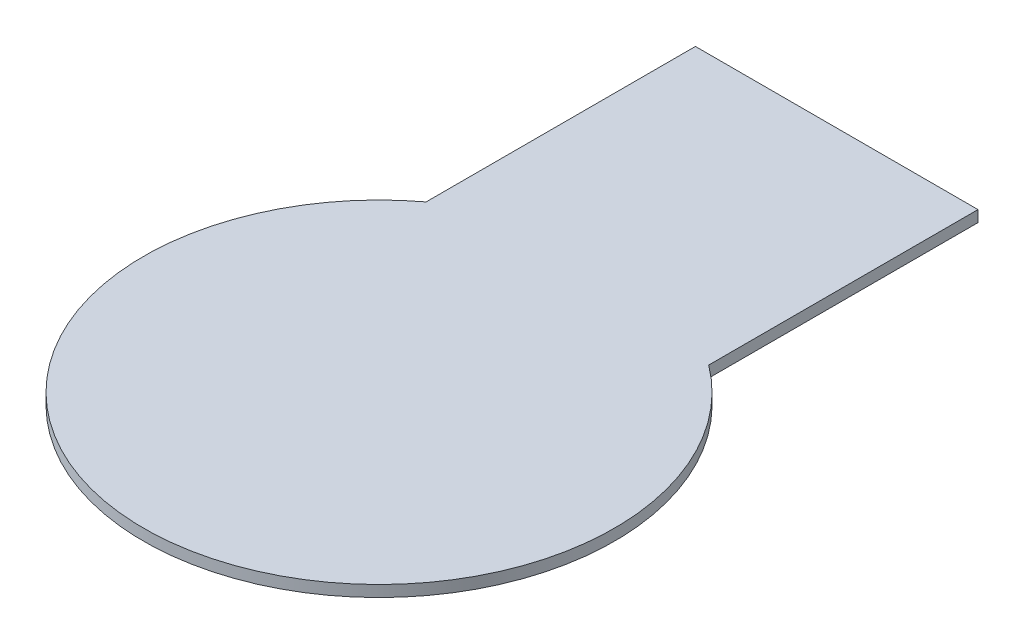
ISO-10303-21;
HEADER;
FILE_DESCRIPTION(('STEP AP214'),'2;1');
FILE_NAME('part.step','',(''),(''),'','','');
FILE_SCHEMA(('AUTOMOTIVE_DESIGN { 1 0 10303 214 1 1 1 1 }'));
ENDSEC;
DATA;
#1=APPLICATION_CONTEXT('core data for automotive mechanical design processes');
#2=APPLICATION_PROTOCOL_DEFINITION('international standard','automotive_design',2000,#1);
#3=PRODUCT_CONTEXT('',#1,'mechanical');
#4=PRODUCT('Part','Part','',(#3));
#5=PRODUCT_RELATED_PRODUCT_CATEGORY('part','',(#4));
#6=PRODUCT_DEFINITION_FORMATION('','',#4);
#7=PRODUCT_DEFINITION_CONTEXT('part definition',#1,'design');
#8=PRODUCT_DEFINITION('design','',#6,#7);
#9=PRODUCT_DEFINITION_SHAPE('','',#8);
#10=(LENGTH_UNIT() NAMED_UNIT(*) SI_UNIT(.MILLI.,.METRE.));
#11=(NAMED_UNIT(*) PLANE_ANGLE_UNIT() SI_UNIT($,.RADIAN.));
#12=(NAMED_UNIT(*) SI_UNIT($,.STERADIAN.) SOLID_ANGLE_UNIT());
#13=UNCERTAINTY_MEASURE_WITH_UNIT(LENGTH_MEASURE(1.E-05),#10,'distance_accuracy_value','');
#14=(GEOMETRIC_REPRESENTATION_CONTEXT(3) GLOBAL_UNCERTAINTY_ASSIGNED_CONTEXT((#13)) GLOBAL_UNIT_ASSIGNED_CONTEXT((#10,
#11,#12)) REPRESENTATION_CONTEXT('',''));
#15=CARTESIAN_POINT('',(0.,0.,0.));
#16=DIRECTION('',(0.,0.,1.));
#17=DIRECTION('',(1.,0.,0.));
#18=AXIS2_PLACEMENT_3D('',#15,#16,#17);
#19=CARTESIAN_POINT('',(0.,0.6,0.));
#20=DIRECTION('',(0.,-1.,0.));
#21=DIRECTION('',(0.,0.,-1.));
#22=AXIS2_PLACEMENT_3D('',#19,#20,#21);
#23=CYLINDRICAL_SURFACE('',#22,12.5);
#24=CARTESIAN_POINT('',(0.,0.,0.));
#25=DIRECTION('',(0.,1.,0.));
#26=DIRECTION('',(0.,0.,1.));
#27=AXIS2_PLACEMENT_3D('',#24,#25,#26);
#28=CIRCLE('',#27,12.5);
#29=CARTESIAN_POINT('',(-7.5,0.,-10.));
#30=VERTEX_POINT('',#29);
#31=CARTESIAN_POINT('',(7.5,0.,-10.));
#32=VERTEX_POINT('',#31);
#33=EDGE_CURVE('E97',#30,#32,#28,.T.);
#34=ORIENTED_EDGE('',*,*,#33,.T.);
#35=DIRECTION('',(0.,-1.,0.));
#36=VECTOR('',#35,1.);
#37=CARTESIAN_POINT('',(7.5,0.6,-10.));
#38=LINE('',#37,#36);
#39=CARTESIAN_POINT('',(7.5,0.6,-10.));
#40=VERTEX_POINT('',#39);
#41=EDGE_CURVE('E11',#40,#32,#38,.T.);
#42=ORIENTED_EDGE('',*,*,#41,.F.);
#43=CARTESIAN_POINT('',(0.,0.6,0.));
#44=DIRECTION('',(0.,1.,0.));
#45=DIRECTION('',(0.,0.,1.));
#46=AXIS2_PLACEMENT_3D('',#43,#44,#45);
#47=CIRCLE('',#46,12.5);
#48=CARTESIAN_POINT('',(-7.5,0.6,-10.));
#49=VERTEX_POINT('',#48);
#50=EDGE_CURVE('E74',#49,#40,#47,.T.);
#51=ORIENTED_EDGE('',*,*,#50,.F.);
#52=DIRECTION('',(0.,-1.,0.));
#53=VECTOR('',#52,1.);
#54=CARTESIAN_POINT('',(-7.5,0.6,-10.));
#55=LINE('',#54,#53);
#56=EDGE_CURVE('E93',#49,#30,#55,.T.);
#57=ORIENTED_EDGE('',*,*,#56,.T.);
#58=EDGE_LOOP('',(#34,#42,#51,#57));
#59=FACE_BOUND('',#58,.T.);
#60=ADVANCED_FACE('F35',(#59),#23,.T.);
#61=CARTESIAN_POINT('',(7.5,0.6,0.));
#62=DIRECTION('',(1.,0.,0.));
#63=DIRECTION('',(0.,0.,-1.));
#64=AXIS2_PLACEMENT_3D('',#61,#62,#63);
#65=PLANE('',#64);
#66=DIRECTION('',(0.,0.,1.));
#67=VECTOR('',#66,1.);
#68=CARTESIAN_POINT('',(7.5,0.,0.));
#69=LINE('',#68,#67);
#70=CARTESIAN_POINT('',(7.5,0.,-24.2954545454546));
#71=VERTEX_POINT('',#70);
#72=EDGE_CURVE('E83',#71,#32,#69,.T.);
#73=ORIENTED_EDGE('',*,*,#72,.F.);
#74=DIRECTION('',(0.,-1.,0.));
#75=VECTOR('',#74,1.);
#76=CARTESIAN_POINT('',(7.5,0.6,-24.2954545454546));
#77=LINE('',#76,#75);
#78=CARTESIAN_POINT('',(7.5,0.6,-24.2954545454546));
#79=VERTEX_POINT('',#78);
#80=EDGE_CURVE('E43',#79,#71,#77,.T.);
#81=ORIENTED_EDGE('',*,*,#80,.F.);
#82=DIRECTION('',(0.,0.,1.));
#83=VECTOR('',#82,1.);
#84=CARTESIAN_POINT('',(7.5,0.6,0.));
#85=LINE('',#84,#83);
#86=EDGE_CURVE('E81',#79,#40,#85,.T.);
#87=ORIENTED_EDGE('',*,*,#86,.T.);
#88=ORIENTED_EDGE('',*,*,#41,.T.);
#89=EDGE_LOOP('',(#73,#81,#87,#88));
#90=FACE_BOUND('',#89,.T.);
#91=ADVANCED_FACE('F80',(#90),#65,.T.);
#92=CARTESIAN_POINT('',(0.,0.6,-24.2954545454546));
#93=DIRECTION('',(0.,0.,-1.));
#94=DIRECTION('',(-1.,0.,0.));
#95=AXIS2_PLACEMENT_3D('',#92,#93,#94);
#96=PLANE('',#95);
#97=DIRECTION('',(1.,0.,0.));
#98=VECTOR('',#97,1.);
#99=CARTESIAN_POINT('',(0.,0.,-24.2954545454546));
#100=LINE('',#99,#98);
#101=CARTESIAN_POINT('',(-7.5,0.,-24.2954545454546));
#102=VERTEX_POINT('',#101);
#103=EDGE_CURVE('E101',#102,#71,#100,.T.);
#104=ORIENTED_EDGE('',*,*,#103,.F.);
#105=DIRECTION('',(0.,-1.,0.));
#106=VECTOR('',#105,1.);
#107=CARTESIAN_POINT('',(-7.5,0.6,-24.2954545454546));
#108=LINE('',#107,#106);
#109=CARTESIAN_POINT('',(-7.5,0.6,-24.2954545454546));
#110=VERTEX_POINT('',#109);
#111=EDGE_CURVE('E66',#110,#102,#108,.T.);
#112=ORIENTED_EDGE('',*,*,#111,.F.);
#113=DIRECTION('',(1.,0.,0.));
#114=VECTOR('',#113,1.);
#115=CARTESIAN_POINT('',(0.,0.6,-24.2954545454546));
#116=LINE('',#115,#114);
#117=EDGE_CURVE('E89',#110,#79,#116,.T.);
#118=ORIENTED_EDGE('',*,*,#117,.T.);
#119=ORIENTED_EDGE('',*,*,#80,.T.);
#120=EDGE_LOOP('',(#104,#112,#118,#119));
#121=FACE_BOUND('',#120,.T.);
#122=ADVANCED_FACE('F91',(#121),#96,.T.);
#123=CARTESIAN_POINT('',(-7.5,0.6,0.));
#124=DIRECTION('',(1.,0.,0.));
#125=DIRECTION('',(0.,0.,-1.));
#126=AXIS2_PLACEMENT_3D('',#123,#124,#125);
#127=PLANE('',#126);
#128=DIRECTION('',(0.,0.,1.));
#129=VECTOR('',#128,1.);
#130=CARTESIAN_POINT('',(-7.5,0.,0.));
#131=LINE('',#130,#129);
#132=EDGE_CURVE('E69',#102,#30,#131,.T.);
#133=ORIENTED_EDGE('',*,*,#132,.T.);
#134=ORIENTED_EDGE('',*,*,#56,.F.);
#135=DIRECTION('',(0.,0.,1.));
#136=VECTOR('',#135,1.);
#137=CARTESIAN_POINT('',(-7.5,0.6,0.));
#138=LINE('',#137,#136);
#139=EDGE_CURVE('E51',#110,#49,#138,.T.);
#140=ORIENTED_EDGE('',*,*,#139,.F.);
#141=ORIENTED_EDGE('',*,*,#111,.T.);
#142=EDGE_LOOP('',(#133,#134,#140,#141));
#143=FACE_BOUND('',#142,.T.);
#144=ADVANCED_FACE('F114',(#143),#127,.F.);
#145=CARTESIAN_POINT('',(0.,0.6,0.));
#146=DIRECTION('',(0.,1.,0.));
#147=DIRECTION('',(0.,0.,1.));
#148=AXIS2_PLACEMENT_3D('',#145,#146,#147);
#149=PLANE('',#148);
#150=ORIENTED_EDGE('',*,*,#50,.T.);
#151=ORIENTED_EDGE('',*,*,#86,.F.);
#152=ORIENTED_EDGE('',*,*,#117,.F.);
#153=ORIENTED_EDGE('',*,*,#139,.T.);
#154=EDGE_LOOP('',(#150,#151,#152,#153));
#155=FACE_BOUND('',#154,.T.);
#156=ADVANCED_FACE('F88',(#155),#149,.T.);
#157=CARTESIAN_POINT('',(0.,0.,0.));
#158=DIRECTION('',(0.,1.,0.));
#159=DIRECTION('',(0.,0.,1.));
#160=AXIS2_PLACEMENT_3D('',#157,#158,#159);
#161=PLANE('',#160);
#162=ORIENTED_EDGE('',*,*,#33,.F.);
#163=ORIENTED_EDGE('',*,*,#132,.F.);
#164=ORIENTED_EDGE('',*,*,#103,.T.);
#165=ORIENTED_EDGE('',*,*,#72,.T.);
#166=EDGE_LOOP('',(#162,#163,#164,#165));
#167=FACE_BOUND('',#166,.T.);
#168=ADVANCED_FACE('F108',(#167),#161,.F.);
#169=CLOSED_SHELL('',(#60,#91,#122,#144,#156,#168));
#170=MANIFOLD_SOLID_BREP('B2',#169);
#171=ADVANCED_BREP_SHAPE_REPRESENTATION('',(#18,#170),#14);
#172=SHAPE_DEFINITION_REPRESENTATION(#9,#171);
ENDSEC;
END-ISO-10303-21;
